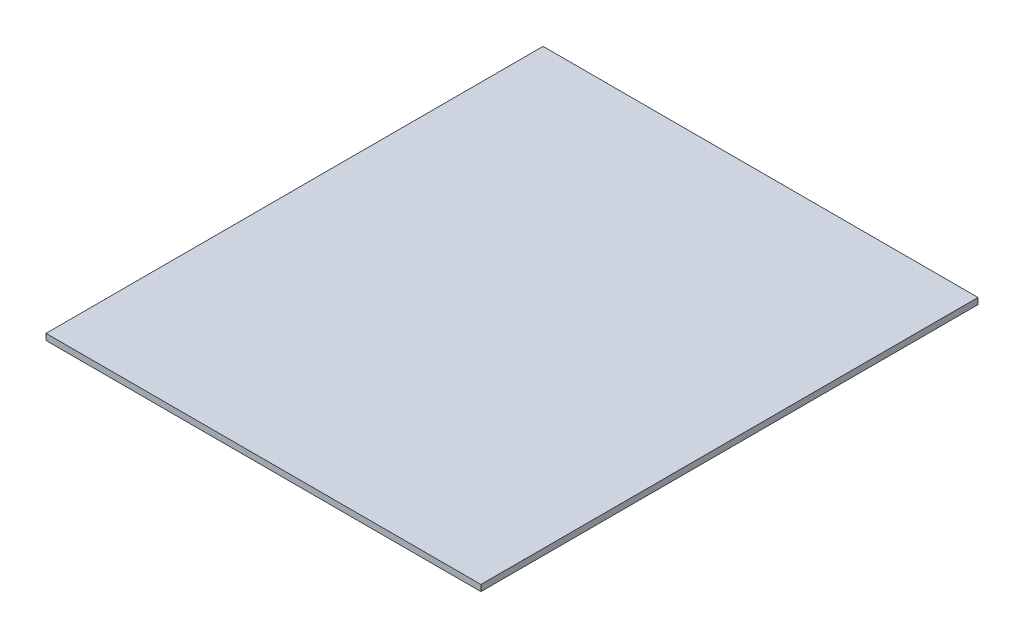
ISO-10303-21;
HEADER;
FILE_DESCRIPTION(('STEP AP214'),'2;1');
FILE_NAME('part.step','',(''),(''),'','','');
FILE_SCHEMA(('AUTOMOTIVE_DESIGN { 1 0 10303 214 1 1 1 1 }'));
ENDSEC;
DATA;
#1=APPLICATION_CONTEXT('core data for automotive mechanical design processes');
#2=APPLICATION_PROTOCOL_DEFINITION('international standard','automotive_design',2000,#1);
#3=PRODUCT_CONTEXT('',#1,'mechanical');
#4=PRODUCT('Part','Part','',(#3));
#5=PRODUCT_RELATED_PRODUCT_CATEGORY('part','',(#4));
#6=PRODUCT_DEFINITION_FORMATION('','',#4);
#7=PRODUCT_DEFINITION_CONTEXT('part definition',#1,'design');
#8=PRODUCT_DEFINITION('design','',#6,#7);
#9=PRODUCT_DEFINITION_SHAPE('','',#8);
#10=(LENGTH_UNIT() NAMED_UNIT(*) SI_UNIT(.MILLI.,.METRE.));
#11=(NAMED_UNIT(*) PLANE_ANGLE_UNIT() SI_UNIT($,.RADIAN.));
#12=(NAMED_UNIT(*) SI_UNIT($,.STERADIAN.) SOLID_ANGLE_UNIT());
#13=UNCERTAINTY_MEASURE_WITH_UNIT(LENGTH_MEASURE(1.E-05),#10,'distance_accuracy_value','');
#14=(GEOMETRIC_REPRESENTATION_CONTEXT(3) GLOBAL_UNCERTAINTY_ASSIGNED_CONTEXT((#13)) GLOBAL_UNIT_ASSIGNED_CONTEXT((#10,
#11,#12)) REPRESENTATION_CONTEXT('',''));
#15=CARTESIAN_POINT('',(0.,0.,0.));
#16=DIRECTION('',(0.,0.,1.));
#17=DIRECTION('',(1.,0.,0.));
#18=AXIS2_PLACEMENT_3D('',#15,#16,#17);
#19=CARTESIAN_POINT('',(157.5,2.75,220.));
#20=DIRECTION('',(-1.,0.,0.));
#21=DIRECTION('',(0.,0.,1.));
#22=AXIS2_PLACEMENT_3D('',#19,#20,#21);
#23=PLANE('',#22);
#24=DIRECTION('',(0.,0.,-1.));
#25=VECTOR('',#24,1.);
#26=CARTESIAN_POINT('',(157.5,-2.25,220.));
#27=LINE('',#26,#25);
#28=CARTESIAN_POINT('',(157.5,-2.25,220.));
#29=VERTEX_POINT('',#28);
#30=CARTESIAN_POINT('',(157.5,-2.25,-180.));
#31=VERTEX_POINT('',#30);
#32=EDGE_CURVE('E107',#29,#31,#27,.T.);
#33=ORIENTED_EDGE('',*,*,#32,.T.);
#34=DIRECTION('',(0.,-1.,0.));
#35=VECTOR('',#34,1.);
#36=CARTESIAN_POINT('',(157.5,2.75,-180.));
#37=LINE('',#36,#35);
#38=CARTESIAN_POINT('',(157.5,2.75,-180.));
#39=VERTEX_POINT('',#38);
#40=EDGE_CURVE('E11',#39,#31,#37,.T.);
#41=ORIENTED_EDGE('',*,*,#40,.F.);
#42=DIRECTION('',(0.,0.,-1.));
#43=VECTOR('',#42,1.);
#44=CARTESIAN_POINT('',(157.5,2.75,220.));
#45=LINE('',#44,#43);
#46=CARTESIAN_POINT('',(157.5,2.75,220.));
#47=VERTEX_POINT('',#46);
#48=EDGE_CURVE('E91',#47,#39,#45,.T.);
#49=ORIENTED_EDGE('',*,*,#48,.F.);
#50=DIRECTION('',(0.,-1.,0.));
#51=VECTOR('',#50,1.);
#52=CARTESIAN_POINT('',(157.5,2.75,220.));
#53=LINE('',#52,#51);
#54=EDGE_CURVE('E103',#47,#29,#53,.T.);
#55=ORIENTED_EDGE('',*,*,#54,.T.);
#56=EDGE_LOOP('',(#33,#41,#49,#55));
#57=FACE_BOUND('',#56,.T.);
#58=ADVANCED_FACE('F39',(#57),#23,.F.);
#59=CARTESIAN_POINT('',(157.5,2.75,-180.));
#60=DIRECTION('',(0.,0.,1.));
#61=DIRECTION('',(1.,0.,0.));
#62=AXIS2_PLACEMENT_3D('',#59,#60,#61);
#63=PLANE('',#62);
#64=DIRECTION('',(-1.,0.,0.));
#65=VECTOR('',#64,1.);
#66=CARTESIAN_POINT('',(157.5,-2.25,-180.));
#67=LINE('',#66,#65);
#68=CARTESIAN_POINT('',(-192.5,-2.25,-180.));
#69=VERTEX_POINT('',#68);
#70=EDGE_CURVE('E96',#31,#69,#67,.T.);
#71=ORIENTED_EDGE('',*,*,#70,.T.);
#72=DIRECTION('',(0.,-1.,0.));
#73=VECTOR('',#72,1.);
#74=CARTESIAN_POINT('',(-192.5,2.75,-180.));
#75=LINE('',#74,#73);
#76=CARTESIAN_POINT('',(-192.5,2.75,-180.));
#77=VERTEX_POINT('',#76);
#78=EDGE_CURVE('E48',#77,#69,#75,.T.);
#79=ORIENTED_EDGE('',*,*,#78,.F.);
#80=DIRECTION('',(-1.,0.,0.));
#81=VECTOR('',#80,1.);
#82=CARTESIAN_POINT('',(157.5,2.75,-180.));
#83=LINE('',#82,#81);
#84=EDGE_CURVE('E86',#39,#77,#83,.T.);
#85=ORIENTED_EDGE('',*,*,#84,.F.);
#86=ORIENTED_EDGE('',*,*,#40,.T.);
#87=EDGE_LOOP('',(#71,#79,#85,#86));
#88=FACE_BOUND('',#87,.T.);
#89=ADVANCED_FACE('F95',(#88),#63,.F.);
#90=CARTESIAN_POINT('',(-192.5,2.75,-180.));
#91=DIRECTION('',(1.,0.,0.));
#92=DIRECTION('',(0.,0.,-1.));
#93=AXIS2_PLACEMENT_3D('',#90,#91,#92);
#94=PLANE('',#93);
#95=DIRECTION('',(0.,0.,1.));
#96=VECTOR('',#95,1.);
#97=CARTESIAN_POINT('',(-192.5,-2.25,-180.));
#98=LINE('',#97,#96);
#99=CARTESIAN_POINT('',(-192.5,-2.25,220.));
#100=VERTEX_POINT('',#99);
#101=EDGE_CURVE('E73',#69,#100,#98,.T.);
#102=ORIENTED_EDGE('',*,*,#101,.T.);
#103=DIRECTION('',(0.,-1.,0.));
#104=VECTOR('',#103,1.);
#105=CARTESIAN_POINT('',(-192.5,2.75,220.));
#106=LINE('',#105,#104);
#107=CARTESIAN_POINT('',(-192.5,2.75,220.));
#108=VERTEX_POINT('',#107);
#109=EDGE_CURVE('E98',#108,#100,#106,.T.);
#110=ORIENTED_EDGE('',*,*,#109,.F.);
#111=DIRECTION('',(0.,0.,1.));
#112=VECTOR('',#111,1.);
#113=CARTESIAN_POINT('',(-192.5,2.75,-180.));
#114=LINE('',#113,#112);
#115=EDGE_CURVE('E89',#77,#108,#114,.T.);
#116=ORIENTED_EDGE('',*,*,#115,.F.);
#117=ORIENTED_EDGE('',*,*,#78,.T.);
#118=EDGE_LOOP('',(#102,#110,#116,#117));
#119=FACE_BOUND('',#118,.T.);
#120=ADVANCED_FACE('F99',(#119),#94,.F.);
#121=CARTESIAN_POINT('',(-192.5,2.75,220.));
#122=DIRECTION('',(0.,0.,-1.));
#123=DIRECTION('',(-1.,0.,0.));
#124=AXIS2_PLACEMENT_3D('',#121,#122,#123);
#125=PLANE('',#124);
#126=DIRECTION('',(1.,0.,0.));
#127=VECTOR('',#126,1.);
#128=CARTESIAN_POINT('',(-192.5,-2.25,220.));
#129=LINE('',#128,#127);
#130=EDGE_CURVE('E79',#100,#29,#129,.T.);
#131=ORIENTED_EDGE('',*,*,#130,.T.);
#132=ORIENTED_EDGE('',*,*,#54,.F.);
#133=DIRECTION('',(1.,0.,0.));
#134=VECTOR('',#133,1.);
#135=CARTESIAN_POINT('',(-192.5,2.75,220.));
#136=LINE('',#135,#134);
#137=EDGE_CURVE('E56',#108,#47,#136,.T.);
#138=ORIENTED_EDGE('',*,*,#137,.F.);
#139=ORIENTED_EDGE('',*,*,#109,.T.);
#140=EDGE_LOOP('',(#131,#132,#138,#139));
#141=FACE_BOUND('',#140,.T.);
#142=ADVANCED_FACE('F120',(#141),#125,.F.);
#143=CARTESIAN_POINT('',(157.5,2.75,-180.));
#144=DIRECTION('',(0.,1.,0.));
#145=DIRECTION('',(0.,0.,1.));
#146=AXIS2_PLACEMENT_3D('',#143,#144,#145);
#147=PLANE('',#146);
#148=ORIENTED_EDGE('',*,*,#48,.T.);
#149=ORIENTED_EDGE('',*,*,#84,.T.);
#150=ORIENTED_EDGE('',*,*,#115,.T.);
#151=ORIENTED_EDGE('',*,*,#137,.T.);
#152=EDGE_LOOP('',(#148,#149,#150,#151));
#153=FACE_BOUND('',#152,.T.);
#154=ADVANCED_FACE('F87',(#153),#147,.T.);
#155=CARTESIAN_POINT('',(157.5,-2.25,-180.));
#156=DIRECTION('',(0.,1.,0.));
#157=DIRECTION('',(0.,0.,1.));
#158=AXIS2_PLACEMENT_3D('',#155,#156,#157);
#159=PLANE('',#158);
#160=ORIENTED_EDGE('',*,*,#32,.F.);
#161=ORIENTED_EDGE('',*,*,#130,.F.);
#162=ORIENTED_EDGE('',*,*,#101,.F.);
#163=ORIENTED_EDGE('',*,*,#70,.F.);
#164=EDGE_LOOP('',(#160,#161,#162,#163));
#165=FACE_BOUND('',#164,.T.);
#166=ADVANCED_FACE('F123',(#165),#159,.F.);
#167=CLOSED_SHELL('',(#58,#89,#120,#142,#154,#166));
#168=MANIFOLD_SOLID_BREP('B2',#167);
#169=ADVANCED_BREP_SHAPE_REPRESENTATION('',(#18,#168),#14);
#170=SHAPE_DEFINITION_REPRESENTATION(#9,#169);
ENDSEC;
END-ISO-10303-21;
